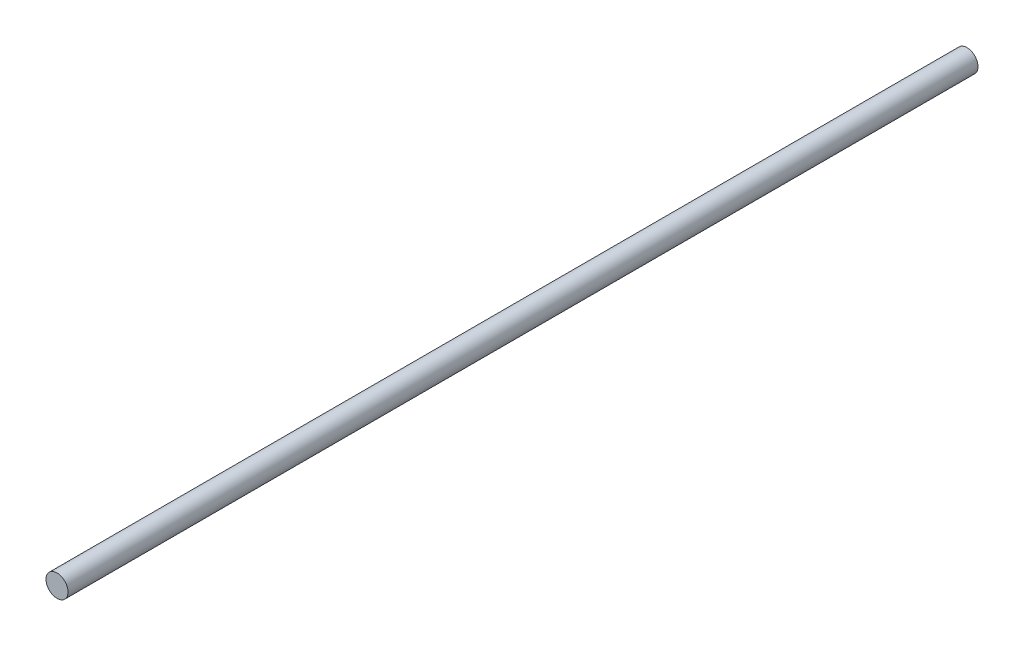
ISO-10303-21;
HEADER;
FILE_DESCRIPTION(('STEP AP214'),'2;1');
FILE_NAME('part.step','',(''),(''),'','','');
FILE_SCHEMA(('AUTOMOTIVE_DESIGN { 1 0 10303 214 1 1 1 1 }'));
ENDSEC;
DATA;
#1=APPLICATION_CONTEXT('core data for automotive mechanical design processes');
#2=APPLICATION_PROTOCOL_DEFINITION('international standard','automotive_design',2000,#1);
#3=PRODUCT_CONTEXT('',#1,'mechanical');
#4=PRODUCT('Part','Part','',(#3));
#5=PRODUCT_RELATED_PRODUCT_CATEGORY('part','',(#4));
#6=PRODUCT_DEFINITION_FORMATION('','',#4);
#7=PRODUCT_DEFINITION_CONTEXT('part definition',#1,'design');
#8=PRODUCT_DEFINITION('design','',#6,#7);
#9=PRODUCT_DEFINITION_SHAPE('','',#8);
#10=(LENGTH_UNIT() NAMED_UNIT(*) SI_UNIT(.MILLI.,.METRE.));
#11=(NAMED_UNIT(*) PLANE_ANGLE_UNIT() SI_UNIT($,.RADIAN.));
#12=(NAMED_UNIT(*) SI_UNIT($,.STERADIAN.) SOLID_ANGLE_UNIT());
#13=UNCERTAINTY_MEASURE_WITH_UNIT(LENGTH_MEASURE(1.E-05),#10,'distance_accuracy_value','');
#14=(GEOMETRIC_REPRESENTATION_CONTEXT(3) GLOBAL_UNCERTAINTY_ASSIGNED_CONTEXT((#13)) GLOBAL_UNIT_ASSIGNED_CONTEXT((#10,
#11,#12)) REPRESENTATION_CONTEXT('',''));
#15=CARTESIAN_POINT('',(0.,0.,0.));
#16=DIRECTION('',(0.,0.,1.));
#17=DIRECTION('',(1.,0.,0.));
#18=AXIS2_PLACEMENT_3D('',#15,#16,#17);
#19=CARTESIAN_POINT('',(0.,0.,165.));
#20=DIRECTION('',(0.,0.,-1.));
#21=DIRECTION('',(-1.,0.,0.));
#22=AXIS2_PLACEMENT_3D('',#19,#20,#21);
#23=CYLINDRICAL_SURFACE('',#22,4.);
#24=CARTESIAN_POINT('',(0.,0.,165.));
#25=DIRECTION('',(0.,0.,1.));
#26=DIRECTION('',(1.,0.,0.));
#27=AXIS2_PLACEMENT_3D('',#24,#25,#26);
#28=CIRCLE('',#27,4.);
#29=CARTESIAN_POINT('',(4.,0.,165.));
#30=VERTEX_POINT('',#29);
#31=EDGE_CURVE('E10',#30,#30,#28,.T.);
#32=ORIENTED_EDGE('',*,*,#31,.F.);
#33=EDGE_LOOP('',(#32));
#34=FACE_BOUND('',#33,.T.);
#35=CARTESIAN_POINT('',(0.,0.,-165.));
#36=DIRECTION('',(0.,0.,1.));
#37=DIRECTION('',(1.,0.,0.));
#38=AXIS2_PLACEMENT_3D('',#35,#36,#37);
#39=CIRCLE('',#38,4.);
#40=CARTESIAN_POINT('',(4.,0.,-165.));
#41=VERTEX_POINT('',#40);
#42=EDGE_CURVE('E46',#41,#41,#39,.T.);
#43=ORIENTED_EDGE('',*,*,#42,.T.);
#44=EDGE_LOOP('',(#43));
#45=FACE_BOUND('',#44,.T.);
#46=ADVANCED_FACE('F43',(#34,#45),#23,.T.);
#47=CARTESIAN_POINT('',(0.,0.,165.));
#48=DIRECTION('',(0.,0.,1.));
#49=DIRECTION('',(1.,0.,0.));
#50=AXIS2_PLACEMENT_3D('',#47,#48,#49);
#51=PLANE('',#50);
#52=ORIENTED_EDGE('',*,*,#31,.T.);
#53=EDGE_LOOP('',(#52));
#54=FACE_BOUND('',#53,.T.);
#55=ADVANCED_FACE('F60',(#54),#51,.T.);
#56=CARTESIAN_POINT('',(0.,0.,-165.));
#57=DIRECTION('',(0.,0.,1.));
#58=DIRECTION('',(1.,0.,0.));
#59=AXIS2_PLACEMENT_3D('',#56,#57,#58);
#60=PLANE('',#59);
#61=ORIENTED_EDGE('',*,*,#42,.F.);
#62=EDGE_LOOP('',(#61));
#63=FACE_BOUND('',#62,.T.);
#64=ADVANCED_FACE('F58',(#63),#60,.F.);
#65=CLOSED_SHELL('',(#46,#55,#64));
#66=MANIFOLD_SOLID_BREP('B2',#65);
#67=ADVANCED_BREP_SHAPE_REPRESENTATION('',(#18,#66),#14);
#68=SHAPE_DEFINITION_REPRESENTATION(#9,#67);
ENDSEC;
END-ISO-10303-21;
